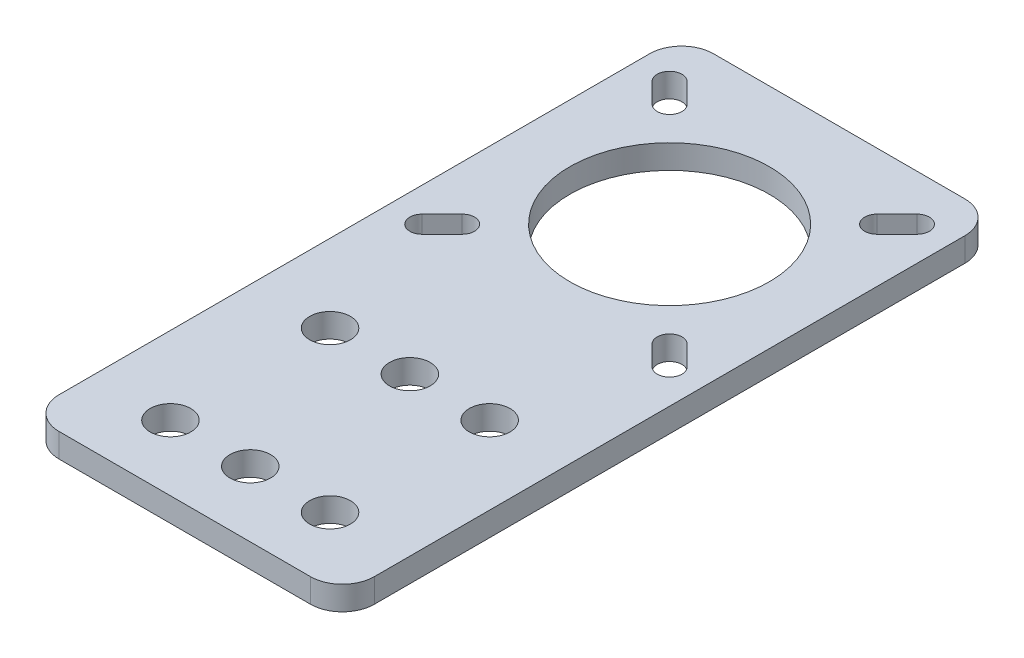
ISO-10303-21;
HEADER;
FILE_DESCRIPTION(('STEP AP214'),'2;1');
FILE_NAME('part.step','',(''),(''),'','','');
FILE_SCHEMA(('AUTOMOTIVE_DESIGN { 1 0 10303 214 1 1 1 1 }'));
ENDSEC;
DATA;
#1=APPLICATION_CONTEXT('core data for automotive mechanical design processes');
#2=APPLICATION_PROTOCOL_DEFINITION('international standard','automotive_design',2000,#1);
#3=PRODUCT_CONTEXT('',#1,'mechanical');
#4=PRODUCT('Part','Part','',(#3));
#5=PRODUCT_RELATED_PRODUCT_CATEGORY('part','',(#4));
#6=PRODUCT_DEFINITION_FORMATION('','',#4);
#7=PRODUCT_DEFINITION_CONTEXT('part definition',#1,'design');
#8=PRODUCT_DEFINITION('design','',#6,#7);
#9=PRODUCT_DEFINITION_SHAPE('','',#8);
#10=(LENGTH_UNIT() NAMED_UNIT(*) SI_UNIT(.MILLI.,.METRE.));
#11=(NAMED_UNIT(*) PLANE_ANGLE_UNIT() SI_UNIT($,.RADIAN.));
#12=(NAMED_UNIT(*) SI_UNIT($,.STERADIAN.) SOLID_ANGLE_UNIT());
#13=UNCERTAINTY_MEASURE_WITH_UNIT(LENGTH_MEASURE(1.E-05),#10,'distance_accuracy_value','');
#14=(GEOMETRIC_REPRESENTATION_CONTEXT(3) GLOBAL_UNCERTAINTY_ASSIGNED_CONTEXT((#13)) GLOBAL_UNIT_ASSIGNED_CONTEXT((#10,
#11,#12)) REPRESENTATION_CONTEXT('',''));
#15=CARTESIAN_POINT('',(0.,0.,0.));
#16=DIRECTION('',(0.,0.,1.));
#17=DIRECTION('',(1.,0.,0.));
#18=AXIS2_PLACEMENT_3D('',#15,#16,#17);
#19=CARTESIAN_POINT('',(-15.75,3.,56.75));
#20=DIRECTION('',(0.,-1.,0.));
#21=DIRECTION('',(0.,0.,-1.));
#22=AXIS2_PLACEMENT_3D('',#19,#20,#21);
#23=PLANE('',#22);
#24=CARTESIAN_POINT('',(-12.9999999999999,3.,13.));
#25=DIRECTION('',(0.,1.,0.));
#26=DIRECTION('',(0.,0.,1.));
#27=AXIS2_PLACEMENT_3D('',#24,#25,#26);
#28=CIRCLE('',#27,1.55);
#29=CARTESIAN_POINT('',(-11.9039844891608,3.,14.0960155108391));
#30=VERTEX_POINT('',#29);
#31=CARTESIAN_POINT('',(-14.0960155108391,3.,11.9039844891609));
#32=VERTEX_POINT('',#31);
#33=EDGE_CURVE('E233',#30,#32,#28,.T.);
#34=ORIENTED_EDGE('',*,*,#33,.F.);
#35=DIRECTION('',(0.707106781186545,0.,-0.70710678118655));
#36=VECTOR('',#35,1.);
#37=CARTESIAN_POINT('',(-11.9039844891608,3.,14.0960155108391));
#38=LINE('',#37,#36);
#39=CARTESIAN_POINT('',(-14.4039844891608,3.,16.5960155108392));
#40=VERTEX_POINT('',#39);
#41=EDGE_CURVE('E241',#40,#30,#38,.T.);
#42=ORIENTED_EDGE('',*,*,#41,.F.);
#43=CARTESIAN_POINT('',(-15.4999999999999,3.,15.5));
#44=DIRECTION('',(0.,1.,0.));
#45=DIRECTION('',(0.,0.,1.));
#46=AXIS2_PLACEMENT_3D('',#43,#44,#45);
#47=CIRCLE('',#46,1.55);
#48=CARTESIAN_POINT('',(-16.5960155108391,3.,14.4039844891608));
#49=VERTEX_POINT('',#48);
#50=EDGE_CURVE('E238',#49,#40,#47,.T.);
#51=ORIENTED_EDGE('',*,*,#50,.F.);
#52=DIRECTION('',(-0.707106781186545,0.,0.70710678118655));
#53=VECTOR('',#52,1.);
#54=CARTESIAN_POINT('',(-14.0960155108391,3.,11.9039844891609));
#55=LINE('',#54,#53);
#56=EDGE_CURVE('E235',#32,#49,#55,.T.);
#57=ORIENTED_EDGE('',*,*,#56,.F.);
#58=EDGE_LOOP('',(#34,#42,#51,#57));
#59=FACE_BOUND('',#58,.T.);
#60=CARTESIAN_POINT('',(-9.99999999999999,3.,32.55));
#61=DIRECTION('',(0.,1.,0.));
#62=DIRECTION('',(0.,0.,1.));
#63=AXIS2_PLACEMENT_3D('',#60,#61,#62);
#64=CIRCLE('',#63,2.55);
#65=CARTESIAN_POINT('',(-9.99999999999999,3.,35.1));
#66=VERTEX_POINT('',#65);
#67=EDGE_CURVE('E295',#66,#66,#64,.T.);
#68=ORIENTED_EDGE('',*,*,#67,.F.);
#69=EDGE_LOOP('',(#68));
#70=FACE_BOUND('',#69,.T.);
#71=CARTESIAN_POINT('',(0.,3.,32.55));
#72=DIRECTION('',(0.,1.,0.));
#73=DIRECTION('',(0.,0.,1.));
#74=AXIS2_PLACEMENT_3D('',#71,#72,#73);
#75=CIRCLE('',#74,2.55);
#76=CARTESIAN_POINT('',(0.,3.,35.1));
#77=VERTEX_POINT('',#76);
#78=EDGE_CURVE('E307',#77,#77,#75,.T.);
#79=ORIENTED_EDGE('',*,*,#78,.F.);
#80=EDGE_LOOP('',(#79));
#81=FACE_BOUND('',#80,.T.);
#82=CARTESIAN_POINT('',(10.,3.,32.55));
#83=DIRECTION('',(0.,1.,0.));
#84=DIRECTION('',(0.,0.,1.));
#85=AXIS2_PLACEMENT_3D('',#82,#83,#84);
#86=CIRCLE('',#85,2.55);
#87=CARTESIAN_POINT('',(10.,3.,35.1));
#88=VERTEX_POINT('',#87);
#89=EDGE_CURVE('E319',#88,#88,#86,.T.);
#90=ORIENTED_EDGE('',*,*,#89,.F.);
#91=EDGE_LOOP('',(#90));
#92=FACE_BOUND('',#91,.T.);
#93=CARTESIAN_POINT('',(12.9999999999999,3.,-13.));
#94=DIRECTION('',(0.,1.,0.));
#95=DIRECTION('',(0.,0.,1.));
#96=AXIS2_PLACEMENT_3D('',#93,#94,#95);
#97=CIRCLE('',#96,1.55);
#98=CARTESIAN_POINT('',(11.9039844891608,3.,-14.0960155108391));
#99=VERTEX_POINT('',#98);
#100=CARTESIAN_POINT('',(14.0960155108391,3.,-11.9039844891608));
#101=VERTEX_POINT('',#100);
#102=EDGE_CURVE('E331',#99,#101,#97,.T.);
#103=ORIENTED_EDGE('',*,*,#102,.F.);
#104=DIRECTION('',(-0.707106781186545,0.,0.70710678118655));
#105=VECTOR('',#104,1.);
#106=CARTESIAN_POINT('',(11.9039844891608,3.,-14.0960155108391));
#107=LINE('',#106,#105);
#108=CARTESIAN_POINT('',(14.4039844891608,3.,-16.5960155108391));
#109=VERTEX_POINT('',#108);
#110=EDGE_CURVE('E339',#109,#99,#107,.T.);
#111=ORIENTED_EDGE('',*,*,#110,.F.);
#112=CARTESIAN_POINT('',(15.4999999999999,3.,-15.5));
#113=DIRECTION('',(0.,1.,0.));
#114=DIRECTION('',(0.,0.,1.));
#115=AXIS2_PLACEMENT_3D('',#112,#113,#114);
#116=CIRCLE('',#115,1.55);
#117=CARTESIAN_POINT('',(16.5960155108391,3.,-14.4039844891608));
#118=VERTEX_POINT('',#117);
#119=EDGE_CURVE('E336',#118,#109,#116,.T.);
#120=ORIENTED_EDGE('',*,*,#119,.F.);
#121=DIRECTION('',(0.707106781186546,0.,-0.707106781186549));
#122=VECTOR('',#121,1.);
#123=CARTESIAN_POINT('',(14.0960155108391,3.,-11.9039844891608));
#124=LINE('',#123,#122);
#125=EDGE_CURVE('E333',#101,#118,#124,.T.);
#126=ORIENTED_EDGE('',*,*,#125,.F.);
#127=EDGE_LOOP('',(#103,#111,#120,#126));
#128=FACE_BOUND('',#127,.T.);
#129=CARTESIAN_POINT('',(-15.75,3.,56.75));
#130=DIRECTION('',(0.,1.,0.));
#131=DIRECTION('',(0.,0.,-1.));
#132=AXIS2_PLACEMENT_3D('',#129,#130,#131);
#133=CIRCLE('',#132,4.00000000000001);
#134=CARTESIAN_POINT('',(-19.75,3.,56.75));
#135=VERTEX_POINT('',#134);
#136=CARTESIAN_POINT('',(-15.75,3.,60.75));
#137=VERTEX_POINT('',#136);
#138=EDGE_CURVE('E368',#135,#137,#133,.T.);
#139=ORIENTED_EDGE('',*,*,#138,.T.);
#140=DIRECTION('',(1.,0.,0.));
#141=VECTOR('',#140,1.);
#142=CARTESIAN_POINT('',(15.75,3.,60.75));
#143=LINE('',#142,#141);
#144=CARTESIAN_POINT('',(15.75,3.,60.75));
#145=VERTEX_POINT('',#144);
#146=EDGE_CURVE('E371',#137,#145,#143,.T.);
#147=ORIENTED_EDGE('',*,*,#146,.T.);
#148=CARTESIAN_POINT('',(15.75,3.,56.75));
#149=DIRECTION('',(0.,1.,0.));
#150=DIRECTION('',(0.,0.,1.));
#151=AXIS2_PLACEMENT_3D('',#148,#149,#150);
#152=CIRCLE('',#151,4.00000000000001);
#153=CARTESIAN_POINT('',(19.75,3.,56.75));
#154=VERTEX_POINT('',#153);
#155=EDGE_CURVE('E374',#145,#154,#152,.T.);
#156=ORIENTED_EDGE('',*,*,#155,.T.);
#157=DIRECTION('',(0.,0.,-1.));
#158=VECTOR('',#157,1.);
#159=CARTESIAN_POINT('',(19.75,3.,56.75));
#160=LINE('',#159,#158);
#161=CARTESIAN_POINT('',(19.75,3.,-17.25));
#162=VERTEX_POINT('',#161);
#163=EDGE_CURVE('E376',#154,#162,#160,.T.);
#164=ORIENTED_EDGE('',*,*,#163,.T.);
#165=CARTESIAN_POINT('',(15.75,3.,-17.25));
#166=DIRECTION('',(0.,1.,0.));
#167=DIRECTION('',(0.,0.,1.));
#168=AXIS2_PLACEMENT_3D('',#165,#166,#167);
#169=CIRCLE('',#168,4.);
#170=CARTESIAN_POINT('',(15.75,3.,-21.25));
#171=VERTEX_POINT('',#170);
#172=EDGE_CURVE('E378',#162,#171,#169,.T.);
#173=ORIENTED_EDGE('',*,*,#172,.T.);
#174=DIRECTION('',(-1.,0.,0.));
#175=VECTOR('',#174,1.);
#176=CARTESIAN_POINT('',(15.75,3.,-21.25));
#177=LINE('',#176,#175);
#178=CARTESIAN_POINT('',(-15.75,3.,-21.25));
#179=VERTEX_POINT('',#178);
#180=EDGE_CURVE('E380',#171,#179,#177,.T.);
#181=ORIENTED_EDGE('',*,*,#180,.T.);
#182=CARTESIAN_POINT('',(-15.75,3.,-17.25));
#183=DIRECTION('',(0.,1.,0.));
#184=DIRECTION('',(0.,0.,1.));
#185=AXIS2_PLACEMENT_3D('',#182,#183,#184);
#186=CIRCLE('',#185,4.);
#187=CARTESIAN_POINT('',(-19.75,3.,-17.25));
#188=VERTEX_POINT('',#187);
#189=EDGE_CURVE('E382',#179,#188,#186,.T.);
#190=ORIENTED_EDGE('',*,*,#189,.T.);
#191=DIRECTION('',(0.,0.,1.));
#192=VECTOR('',#191,1.);
#193=CARTESIAN_POINT('',(-19.75,3.,56.75));
#194=LINE('',#193,#192);
#195=EDGE_CURVE('E384',#188,#135,#194,.T.);
#196=ORIENTED_EDGE('',*,*,#195,.T.);
#197=EDGE_LOOP('',(#139,#147,#156,#164,#173,#181,#190,#196));
#198=FACE_BOUND('',#197,.T.);
#199=CARTESIAN_POINT('',(0.,3.,0.));
#200=DIRECTION('',(0.,1.,0.));
#201=DIRECTION('',(0.,0.,1.));
#202=AXIS2_PLACEMENT_3D('',#199,#200,#201);
#203=CIRCLE('',#202,12.5);
#204=CARTESIAN_POINT('',(0.,3.,12.5));
#205=VERTEX_POINT('',#204);
#206=EDGE_CURVE('E362',#205,#205,#203,.T.);
#207=ORIENTED_EDGE('',*,*,#206,.F.);
#208=EDGE_LOOP('',(#207));
#209=FACE_BOUND('',#208,.T.);
#210=CARTESIAN_POINT('',(10.,3.,52.55));
#211=DIRECTION('',(0.,1.,0.));
#212=DIRECTION('',(0.,0.,1.));
#213=AXIS2_PLACEMENT_3D('',#210,#211,#212);
#214=CIRCLE('',#213,2.55);
#215=CARTESIAN_POINT('',(10.,3.,55.1));
#216=VERTEX_POINT('',#215);
#217=EDGE_CURVE('E325',#216,#216,#214,.T.);
#218=ORIENTED_EDGE('',*,*,#217,.F.);
#219=EDGE_LOOP('',(#218));
#220=FACE_BOUND('',#219,.T.);
#221=CARTESIAN_POINT('',(0.,3.,52.55));
#222=DIRECTION('',(0.,1.,0.));
#223=DIRECTION('',(0.,0.,1.));
#224=AXIS2_PLACEMENT_3D('',#221,#222,#223);
#225=CIRCLE('',#224,2.55);
#226=CARTESIAN_POINT('',(0.,3.,55.1));
#227=VERTEX_POINT('',#226);
#228=EDGE_CURVE('E313',#227,#227,#225,.T.);
#229=ORIENTED_EDGE('',*,*,#228,.F.);
#230=EDGE_LOOP('',(#229));
#231=FACE_BOUND('',#230,.T.);
#232=CARTESIAN_POINT('',(-9.99999999999999,3.,52.55));
#233=DIRECTION('',(0.,1.,0.));
#234=DIRECTION('',(0.,0.,1.));
#235=AXIS2_PLACEMENT_3D('',#232,#233,#234);
#236=CIRCLE('',#235,2.55);
#237=CARTESIAN_POINT('',(-9.99999999999999,3.,55.1));
#238=VERTEX_POINT('',#237);
#239=EDGE_CURVE('E301',#238,#238,#236,.T.);
#240=ORIENTED_EDGE('',*,*,#239,.F.);
#241=EDGE_LOOP('',(#240));
#242=FACE_BOUND('',#241,.T.);
#243=CARTESIAN_POINT('',(-12.9999999999999,3.,-13.));
#244=DIRECTION('',(0.,1.,0.));
#245=DIRECTION('',(0.,0.,-1.));
#246=AXIS2_PLACEMENT_3D('',#243,#244,#245);
#247=CIRCLE('',#246,1.55);
#248=CARTESIAN_POINT('',(-14.0960155108391,3.,-11.9039844891609));
#249=VERTEX_POINT('',#248);
#250=CARTESIAN_POINT('',(-11.9039844891608,3.,-14.0960155108391));
#251=VERTEX_POINT('',#250);
#252=EDGE_CURVE('E264',#249,#251,#247,.T.);
#253=ORIENTED_EDGE('',*,*,#252,.F.);
#254=DIRECTION('',(0.707106781186545,0.,0.70710678118655));
#255=VECTOR('',#254,1.);
#256=CARTESIAN_POINT('',(-14.0960155108391,3.,-11.9039844891609));
#257=LINE('',#256,#255);
#258=CARTESIAN_POINT('',(-16.5960155108391,3.,-14.4039844891609));
#259=VERTEX_POINT('',#258);
#260=EDGE_CURVE('E272',#259,#249,#257,.T.);
#261=ORIENTED_EDGE('',*,*,#260,.F.);
#262=CARTESIAN_POINT('',(-15.4999999999999,3.,-15.5));
#263=DIRECTION('',(0.,1.,0.));
#264=DIRECTION('',(0.,0.,-1.));
#265=AXIS2_PLACEMENT_3D('',#262,#263,#264);
#266=CIRCLE('',#265,1.55);
#267=CARTESIAN_POINT('',(-14.4039844891608,3.,-16.5960155108391));
#268=VERTEX_POINT('',#267);
#269=EDGE_CURVE('E269',#268,#259,#266,.T.);
#270=ORIENTED_EDGE('',*,*,#269,.F.);
#271=DIRECTION('',(-0.707106781186545,0.,-0.70710678118655));
#272=VECTOR('',#271,1.);
#273=CARTESIAN_POINT('',(-11.9039844891608,3.,-14.0960155108391));
#274=LINE('',#273,#272);
#275=EDGE_CURVE('E266',#251,#268,#274,.T.);
#276=ORIENTED_EDGE('',*,*,#275,.F.);
#277=EDGE_LOOP('',(#253,#261,#270,#276));
#278=FACE_BOUND('',#277,.T.);
#279=CARTESIAN_POINT('',(12.9999999999999,3.,13.));
#280=DIRECTION('',(0.,1.,0.));
#281=DIRECTION('',(0.,0.,-1.));
#282=AXIS2_PLACEMENT_3D('',#279,#280,#281);
#283=CIRCLE('',#282,1.55);
#284=CARTESIAN_POINT('',(14.0960155108391,3.,11.9039844891608));
#285=VERTEX_POINT('',#284);
#286=CARTESIAN_POINT('',(11.9039844891608,3.,14.0960155108391));
#287=VERTEX_POINT('',#286);
#288=EDGE_CURVE('E197',#285,#287,#283,.T.);
#289=ORIENTED_EDGE('',*,*,#288,.F.);
#290=DIRECTION('',(-0.707106781186546,0.,-0.707106781186549));
#291=VECTOR('',#290,1.);
#292=CARTESIAN_POINT('',(14.0960155108391,3.,11.9039844891608));
#293=LINE('',#292,#291);
#294=CARTESIAN_POINT('',(16.5960155108391,3.,14.4039844891608));
#295=VERTEX_POINT('',#294);
#296=EDGE_CURVE('E219',#295,#285,#293,.T.);
#297=ORIENTED_EDGE('',*,*,#296,.F.);
#298=CARTESIAN_POINT('',(15.4999999999999,3.,15.5));
#299=DIRECTION('',(0.,1.,0.));
#300=DIRECTION('',(0.,0.,-1.));
#301=AXIS2_PLACEMENT_3D('',#298,#299,#300);
#302=CIRCLE('',#301,1.55);
#303=CARTESIAN_POINT('',(14.4039844891608,3.,16.5960155108391));
#304=VERTEX_POINT('',#303);
#305=EDGE_CURVE('E217',#304,#295,#302,.T.);
#306=ORIENTED_EDGE('',*,*,#305,.F.);
#307=DIRECTION('',(0.707106781186545,0.,0.70710678118655));
#308=VECTOR('',#307,1.);
#309=CARTESIAN_POINT('',(11.9039844891608,3.,14.0960155108391));
#310=LINE('',#309,#308);
#311=EDGE_CURVE('E205',#287,#304,#310,.T.);
#312=ORIENTED_EDGE('',*,*,#311,.F.);
#313=EDGE_LOOP('',(#289,#297,#306,#312));
#314=FACE_BOUND('',#313,.T.);
#315=ADVANCED_FACE('F36',(#59,#70,#81,#92,#128,#198,#209,#220,#231,#242,#278,#314),#23,.F.);
#316=CARTESIAN_POINT('',(-15.75,0.,56.75));
#317=DIRECTION('',(0.,-1.,0.));
#318=DIRECTION('',(0.,0.,-1.));
#319=AXIS2_PLACEMENT_3D('',#316,#317,#318);
#320=PLANE('',#319);
#321=DIRECTION('',(0.707106781186545,0.,-0.70710678118655));
#322=VECTOR('',#321,1.);
#323=CARTESIAN_POINT('',(-11.9039844891608,0.,14.0960155108391));
#324=LINE('',#323,#322);
#325=CARTESIAN_POINT('',(-14.4039844891608,0.,16.5960155108391));
#326=VERTEX_POINT('',#325);
#327=CARTESIAN_POINT('',(-11.9039844891608,0.,14.0960155108391));
#328=VERTEX_POINT('',#327);
#329=EDGE_CURVE('E236',#326,#328,#324,.T.);
#330=ORIENTED_EDGE('',*,*,#329,.T.);
#331=CARTESIAN_POINT('',(-12.9999999999999,0.,13.));
#332=DIRECTION('',(0.,1.,0.));
#333=DIRECTION('',(0.,0.,1.));
#334=AXIS2_PLACEMENT_3D('',#331,#332,#333);
#335=CIRCLE('',#334,1.55);
#336=CARTESIAN_POINT('',(-14.0960155108391,0.,11.9039844891609));
#337=VERTEX_POINT('',#336);
#338=EDGE_CURVE('E213',#328,#337,#335,.T.);
#339=ORIENTED_EDGE('',*,*,#338,.T.);
#340=DIRECTION('',(-0.707106781186545,0.,0.70710678118655));
#341=VECTOR('',#340,1.);
#342=CARTESIAN_POINT('',(-14.0960155108391,0.,11.9039844891609));
#343=LINE('',#342,#341);
#344=CARTESIAN_POINT('',(-16.5960155108391,0.,14.4039844891608));
#345=VERTEX_POINT('',#344);
#346=EDGE_CURVE('E246',#337,#345,#343,.T.);
#347=ORIENTED_EDGE('',*,*,#346,.T.);
#348=CARTESIAN_POINT('',(-15.4999999999999,0.,15.5));
#349=DIRECTION('',(0.,1.,0.));
#350=DIRECTION('',(0.,0.,1.));
#351=AXIS2_PLACEMENT_3D('',#348,#349,#350);
#352=CIRCLE('',#351,1.55);
#353=EDGE_CURVE('E249',#345,#326,#352,.T.);
#354=ORIENTED_EDGE('',*,*,#353,.T.);
#355=EDGE_LOOP('',(#330,#339,#347,#354));
#356=FACE_BOUND('',#355,.T.);
#357=CARTESIAN_POINT('',(-9.99999999999999,0.,32.55));
#358=DIRECTION('',(0.,1.,0.));
#359=DIRECTION('',(0.,0.,1.));
#360=AXIS2_PLACEMENT_3D('',#357,#358,#359);
#361=CIRCLE('',#360,2.55);
#362=CARTESIAN_POINT('',(-9.99999999999999,0.,35.1));
#363=VERTEX_POINT('',#362);
#364=EDGE_CURVE('E294',#363,#363,#361,.T.);
#365=ORIENTED_EDGE('',*,*,#364,.T.);
#366=EDGE_LOOP('',(#365));
#367=FACE_BOUND('',#366,.T.);
#368=CARTESIAN_POINT('',(0.,0.,32.55));
#369=DIRECTION('',(0.,1.,0.));
#370=DIRECTION('',(0.,0.,1.));
#371=AXIS2_PLACEMENT_3D('',#368,#369,#370);
#372=CIRCLE('',#371,2.55);
#373=CARTESIAN_POINT('',(0.,0.,35.1));
#374=VERTEX_POINT('',#373);
#375=EDGE_CURVE('E304',#374,#374,#372,.T.);
#376=ORIENTED_EDGE('',*,*,#375,.T.);
#377=EDGE_LOOP('',(#376));
#378=FACE_BOUND('',#377,.T.);
#379=CARTESIAN_POINT('',(10.,0.,32.55));
#380=DIRECTION('',(0.,1.,0.));
#381=DIRECTION('',(0.,0.,1.));
#382=AXIS2_PLACEMENT_3D('',#379,#380,#381);
#383=CIRCLE('',#382,2.55);
#384=CARTESIAN_POINT('',(10.,0.,35.1));
#385=VERTEX_POINT('',#384);
#386=EDGE_CURVE('E316',#385,#385,#383,.T.);
#387=ORIENTED_EDGE('',*,*,#386,.T.);
#388=EDGE_LOOP('',(#387));
#389=FACE_BOUND('',#388,.T.);
#390=DIRECTION('',(-0.707106781186545,0.,0.70710678118655));
#391=VECTOR('',#390,1.);
#392=CARTESIAN_POINT('',(11.9039844891608,0.,-14.0960155108391));
#393=LINE('',#392,#391);
#394=CARTESIAN_POINT('',(14.4039844891608,0.,-16.5960155108391));
#395=VERTEX_POINT('',#394);
#396=CARTESIAN_POINT('',(11.9039844891608,0.,-14.0960155108391));
#397=VERTEX_POINT('',#396);
#398=EDGE_CURVE('E334',#395,#397,#393,.T.);
#399=ORIENTED_EDGE('',*,*,#398,.T.);
#400=CARTESIAN_POINT('',(12.9999999999999,0.,-13.));
#401=DIRECTION('',(0.,1.,0.));
#402=DIRECTION('',(0.,0.,1.));
#403=AXIS2_PLACEMENT_3D('',#400,#401,#402);
#404=CIRCLE('',#403,1.55);
#405=CARTESIAN_POINT('',(14.0960155108391,0.,-11.9039844891608));
#406=VERTEX_POINT('',#405);
#407=EDGE_CURVE('E328',#397,#406,#404,.T.);
#408=ORIENTED_EDGE('',*,*,#407,.T.);
#409=DIRECTION('',(0.707106781186546,0.,-0.707106781186549));
#410=VECTOR('',#409,1.);
#411=CARTESIAN_POINT('',(14.0960155108391,0.,-11.9039844891608));
#412=LINE('',#411,#410);
#413=CARTESIAN_POINT('',(16.5960155108391,0.,-14.4039844891608));
#414=VERTEX_POINT('',#413);
#415=EDGE_CURVE('E344',#406,#414,#412,.T.);
#416=ORIENTED_EDGE('',*,*,#415,.T.);
#417=CARTESIAN_POINT('',(15.4999999999999,0.,-15.5));
#418=DIRECTION('',(0.,1.,0.));
#419=DIRECTION('',(0.,0.,1.));
#420=AXIS2_PLACEMENT_3D('',#417,#418,#419);
#421=CIRCLE('',#420,1.55);
#422=EDGE_CURVE('E347',#414,#395,#421,.T.);
#423=ORIENTED_EDGE('',*,*,#422,.T.);
#424=EDGE_LOOP('',(#399,#408,#416,#423));
#425=FACE_BOUND('',#424,.T.);
#426=CARTESIAN_POINT('',(-15.75,0.,56.75));
#427=DIRECTION('',(0.,1.,0.));
#428=DIRECTION('',(0.,0.,-1.));
#429=AXIS2_PLACEMENT_3D('',#426,#427,#428);
#430=CIRCLE('',#429,4.00000000000001);
#431=CARTESIAN_POINT('',(-19.75,0.,56.75));
#432=VERTEX_POINT('',#431);
#433=CARTESIAN_POINT('',(-15.75,0.,60.75));
#434=VERTEX_POINT('',#433);
#435=EDGE_CURVE('E365',#432,#434,#430,.T.);
#436=ORIENTED_EDGE('',*,*,#435,.F.);
#437=DIRECTION('',(0.,0.,1.));
#438=VECTOR('',#437,1.);
#439=CARTESIAN_POINT('',(-19.75,0.,56.75));
#440=LINE('',#439,#438);
#441=CARTESIAN_POINT('',(-19.75,0.,-17.25));
#442=VERTEX_POINT('',#441);
#443=EDGE_CURVE('E372',#442,#432,#440,.T.);
#444=ORIENTED_EDGE('',*,*,#443,.F.);
#445=CARTESIAN_POINT('',(-15.75,0.,-17.25));
#446=DIRECTION('',(0.,1.,0.));
#447=DIRECTION('',(0.,0.,1.));
#448=AXIS2_PLACEMENT_3D('',#445,#446,#447);
#449=CIRCLE('',#448,4.);
#450=CARTESIAN_POINT('',(-15.75,0.,-21.25));
#451=VERTEX_POINT('',#450);
#452=EDGE_CURVE('E399',#451,#442,#449,.T.);
#453=ORIENTED_EDGE('',*,*,#452,.F.);
#454=DIRECTION('',(-1.,0.,0.));
#455=VECTOR('',#454,1.);
#456=CARTESIAN_POINT('',(15.75,0.,-21.25));
#457=LINE('',#456,#455);
#458=CARTESIAN_POINT('',(15.75,0.,-21.25));
#459=VERTEX_POINT('',#458);
#460=EDGE_CURVE('E397',#459,#451,#457,.T.);
#461=ORIENTED_EDGE('',*,*,#460,.F.);
#462=CARTESIAN_POINT('',(15.75,0.,-17.25));
#463=DIRECTION('',(0.,1.,0.));
#464=DIRECTION('',(0.,0.,1.));
#465=AXIS2_PLACEMENT_3D('',#462,#463,#464);
#466=CIRCLE('',#465,4.);
#467=CARTESIAN_POINT('',(19.75,0.,-17.25));
#468=VERTEX_POINT('',#467);
#469=EDGE_CURVE('E395',#468,#459,#466,.T.);
#470=ORIENTED_EDGE('',*,*,#469,.F.);
#471=DIRECTION('',(0.,0.,-1.));
#472=VECTOR('',#471,1.);
#473=CARTESIAN_POINT('',(19.75,0.,56.75));
#474=LINE('',#473,#472);
#475=CARTESIAN_POINT('',(19.75,0.,56.75));
#476=VERTEX_POINT('',#475);
#477=EDGE_CURVE('E393',#476,#468,#474,.T.);
#478=ORIENTED_EDGE('',*,*,#477,.F.);
#479=CARTESIAN_POINT('',(15.75,0.,56.75));
#480=DIRECTION('',(0.,1.,0.));
#481=DIRECTION('',(0.,0.,1.));
#482=AXIS2_PLACEMENT_3D('',#479,#480,#481);
#483=CIRCLE('',#482,4.00000000000001);
#484=CARTESIAN_POINT('',(15.75,0.,60.75));
#485=VERTEX_POINT('',#484);
#486=EDGE_CURVE('E391',#485,#476,#483,.T.);
#487=ORIENTED_EDGE('',*,*,#486,.F.);
#488=DIRECTION('',(1.,0.,0.));
#489=VECTOR('',#488,1.);
#490=CARTESIAN_POINT('',(15.75,0.,60.75));
#491=LINE('',#490,#489);
#492=EDGE_CURVE('E389',#434,#485,#491,.T.);
#493=ORIENTED_EDGE('',*,*,#492,.F.);
#494=EDGE_LOOP('',(#436,#444,#453,#461,#470,#478,#487,#493));
#495=FACE_BOUND('',#494,.T.);
#496=CARTESIAN_POINT('',(0.,0.,0.));
#497=DIRECTION('',(0.,1.,0.));
#498=DIRECTION('',(0.,0.,1.));
#499=AXIS2_PLACEMENT_3D('',#496,#497,#498);
#500=CIRCLE('',#499,12.5);
#501=CARTESIAN_POINT('',(0.,0.,12.5));
#502=VERTEX_POINT('',#501);
#503=EDGE_CURVE('E361',#502,#502,#500,.T.);
#504=ORIENTED_EDGE('',*,*,#503,.T.);
#505=EDGE_LOOP('',(#504));
#506=FACE_BOUND('',#505,.T.);
#507=CARTESIAN_POINT('',(10.,0.,52.55));
#508=DIRECTION('',(0.,1.,0.));
#509=DIRECTION('',(0.,0.,1.));
#510=AXIS2_PLACEMENT_3D('',#507,#508,#509);
#511=CIRCLE('',#510,2.55);
#512=CARTESIAN_POINT('',(10.,0.,55.1));
#513=VERTEX_POINT('',#512);
#514=EDGE_CURVE('E322',#513,#513,#511,.T.);
#515=ORIENTED_EDGE('',*,*,#514,.T.);
#516=EDGE_LOOP('',(#515));
#517=FACE_BOUND('',#516,.T.);
#518=CARTESIAN_POINT('',(0.,0.,52.55));
#519=DIRECTION('',(0.,1.,0.));
#520=DIRECTION('',(0.,0.,1.));
#521=AXIS2_PLACEMENT_3D('',#518,#519,#520);
#522=CIRCLE('',#521,2.55);
#523=CARTESIAN_POINT('',(0.,0.,55.1));
#524=VERTEX_POINT('',#523);
#525=EDGE_CURVE('E310',#524,#524,#522,.T.);
#526=ORIENTED_EDGE('',*,*,#525,.T.);
#527=EDGE_LOOP('',(#526));
#528=FACE_BOUND('',#527,.T.);
#529=CARTESIAN_POINT('',(-9.99999999999999,0.,52.55));
#530=DIRECTION('',(0.,1.,0.));
#531=DIRECTION('',(0.,0.,1.));
#532=AXIS2_PLACEMENT_3D('',#529,#530,#531);
#533=CIRCLE('',#532,2.55);
#534=CARTESIAN_POINT('',(-9.99999999999999,0.,55.1));
#535=VERTEX_POINT('',#534);
#536=EDGE_CURVE('E298',#535,#535,#533,.T.);
#537=ORIENTED_EDGE('',*,*,#536,.T.);
#538=EDGE_LOOP('',(#537));
#539=FACE_BOUND('',#538,.T.);
#540=DIRECTION('',(0.707106781186545,0.,0.70710678118655));
#541=VECTOR('',#540,1.);
#542=CARTESIAN_POINT('',(-14.0960155108391,0.,-11.9039844891609));
#543=LINE('',#542,#541);
#544=CARTESIAN_POINT('',(-16.5960155108391,0.,-14.4039844891608));
#545=VERTEX_POINT('',#544);
#546=CARTESIAN_POINT('',(-14.0960155108391,0.,-11.9039844891609));
#547=VERTEX_POINT('',#546);
#548=EDGE_CURVE('E267',#545,#547,#543,.T.);
#549=ORIENTED_EDGE('',*,*,#548,.T.);
#550=CARTESIAN_POINT('',(-12.9999999999999,0.,-13.));
#551=DIRECTION('',(0.,1.,0.));
#552=DIRECTION('',(0.,0.,-1.));
#553=AXIS2_PLACEMENT_3D('',#550,#551,#552);
#554=CIRCLE('',#553,1.55);
#555=CARTESIAN_POINT('',(-11.9039844891608,0.,-14.0960155108391));
#556=VERTEX_POINT('',#555);
#557=EDGE_CURVE('E263',#547,#556,#554,.T.);
#558=ORIENTED_EDGE('',*,*,#557,.T.);
#559=DIRECTION('',(-0.707106781186545,0.,-0.70710678118655));
#560=VECTOR('',#559,1.);
#561=CARTESIAN_POINT('',(-11.9039844891608,0.,-14.0960155108391));
#562=LINE('',#561,#560);
#563=CARTESIAN_POINT('',(-14.4039844891608,0.,-16.5960155108391));
#564=VERTEX_POINT('',#563);
#565=EDGE_CURVE('E277',#556,#564,#562,.T.);
#566=ORIENTED_EDGE('',*,*,#565,.T.);
#567=CARTESIAN_POINT('',(-15.4999999999999,0.,-15.5));
#568=DIRECTION('',(0.,1.,0.));
#569=DIRECTION('',(0.,0.,-1.));
#570=AXIS2_PLACEMENT_3D('',#567,#568,#569);
#571=CIRCLE('',#570,1.55);
#572=EDGE_CURVE('E280',#564,#545,#571,.T.);
#573=ORIENTED_EDGE('',*,*,#572,.T.);
#574=EDGE_LOOP('',(#549,#558,#566,#573));
#575=FACE_BOUND('',#574,.T.);
#576=DIRECTION('',(-0.707106781186546,0.,-0.707106781186549));
#577=VECTOR('',#576,1.);
#578=CARTESIAN_POINT('',(14.0960155108391,0.,11.9039844891608));
#579=LINE('',#578,#577);
#580=CARTESIAN_POINT('',(16.5960155108391,0.,14.4039844891608));
#581=VERTEX_POINT('',#580);
#582=CARTESIAN_POINT('',(14.0960155108391,0.,11.9039844891608));
#583=VERTEX_POINT('',#582);
#584=EDGE_CURVE('E206',#581,#583,#579,.T.);
#585=ORIENTED_EDGE('',*,*,#584,.T.);
#586=CARTESIAN_POINT('',(12.9999999999999,0.,13.));
#587=DIRECTION('',(0.,1.,0.));
#588=DIRECTION('',(0.,0.,-1.));
#589=AXIS2_PLACEMENT_3D('',#586,#587,#588);
#590=CIRCLE('',#589,1.55);
#591=CARTESIAN_POINT('',(11.9039844891608,0.,14.0960155108391));
#592=VERTEX_POINT('',#591);
#593=EDGE_CURVE('E59',#583,#592,#590,.T.);
#594=ORIENTED_EDGE('',*,*,#593,.T.);
#595=DIRECTION('',(0.707106781186545,0.,0.70710678118655));
#596=VECTOR('',#595,1.);
#597=CARTESIAN_POINT('',(11.9039844891608,0.,14.0960155108391));
#598=LINE('',#597,#596);
#599=CARTESIAN_POINT('',(14.4039844891608,0.,16.5960155108391));
#600=VERTEX_POINT('',#599);
#601=EDGE_CURVE('E212',#592,#600,#598,.T.);
#602=ORIENTED_EDGE('',*,*,#601,.T.);
#603=CARTESIAN_POINT('',(15.4999999999999,0.,15.5));
#604=DIRECTION('',(0.,1.,0.));
#605=DIRECTION('',(0.,0.,-1.));
#606=AXIS2_PLACEMENT_3D('',#603,#604,#605);
#607=CIRCLE('',#606,1.55);
#608=EDGE_CURVE('E225',#600,#581,#607,.T.);
#609=ORIENTED_EDGE('',*,*,#608,.T.);
#610=EDGE_LOOP('',(#585,#594,#602,#609));
#611=FACE_BOUND('',#610,.T.);
#612=ADVANCED_FACE('F429',(#356,#367,#378,#389,#425,#495,#506,#517,#528,#539,#575,#611),#320,.T.);
#613=CARTESIAN_POINT('',(-15.75,3.,56.75));
#614=DIRECTION('',(0.,-1.,0.));
#615=DIRECTION('',(0.,0.,-1.));
#616=AXIS2_PLACEMENT_3D('',#613,#614,#615);
#617=CYLINDRICAL_SURFACE('',#616,4.00000000000001);
#618=ORIENTED_EDGE('',*,*,#435,.T.);
#619=DIRECTION('',(0.,-1.,0.));
#620=VECTOR('',#619,1.);
#621=CARTESIAN_POINT('',(-15.75,3.,60.75));
#622=LINE('',#621,#620);
#623=EDGE_CURVE('E11',#137,#434,#622,.T.);
#624=ORIENTED_EDGE('',*,*,#623,.F.);
#625=ORIENTED_EDGE('',*,*,#138,.F.);
#626=DIRECTION('',(0.,-1.,0.));
#627=VECTOR('',#626,1.);
#628=CARTESIAN_POINT('',(-19.75,3.,56.75));
#629=LINE('',#628,#627);
#630=EDGE_CURVE('E386',#135,#432,#629,.T.);
#631=ORIENTED_EDGE('',*,*,#630,.T.);
#632=EDGE_LOOP('',(#618,#624,#625,#631));
#633=FACE_BOUND('',#632,.T.);
#634=ADVANCED_FACE('F38',(#633),#617,.T.);
#635=CARTESIAN_POINT('',(15.75,3.,60.75));
#636=DIRECTION('',(0.,0.,-1.));
#637=DIRECTION('',(-1.,0.,0.));
#638=AXIS2_PLACEMENT_3D('',#635,#636,#637);
#639=PLANE('',#638);
#640=ORIENTED_EDGE('',*,*,#492,.T.);
#641=DIRECTION('',(0.,-1.,0.));
#642=VECTOR('',#641,1.);
#643=CARTESIAN_POINT('',(15.75,3.,60.75));
#644=LINE('',#643,#642);
#645=EDGE_CURVE('E44',#145,#485,#644,.T.);
#646=ORIENTED_EDGE('',*,*,#645,.F.);
#647=ORIENTED_EDGE('',*,*,#146,.F.);
#648=ORIENTED_EDGE('',*,*,#623,.T.);
#649=EDGE_LOOP('',(#640,#646,#647,#648));
#650=FACE_BOUND('',#649,.T.);
#651=ADVANCED_FACE('F447',(#650),#639,.F.);
#652=CARTESIAN_POINT('',(15.75,3.,56.75));
#653=DIRECTION('',(0.,-1.,0.));
#654=DIRECTION('',(0.,0.,-1.));
#655=AXIS2_PLACEMENT_3D('',#652,#653,#654);
#656=CYLINDRICAL_SURFACE('',#655,4.00000000000001);
#657=ORIENTED_EDGE('',*,*,#486,.T.);
#658=DIRECTION('',(0.,-1.,0.));
#659=VECTOR('',#658,1.);
#660=CARTESIAN_POINT('',(19.75,3.,56.75));
#661=LINE('',#660,#659);
#662=EDGE_CURVE('E416',#154,#476,#661,.T.);
#663=ORIENTED_EDGE('',*,*,#662,.F.);
#664=ORIENTED_EDGE('',*,*,#155,.F.);
#665=ORIENTED_EDGE('',*,*,#645,.T.);
#666=EDGE_LOOP('',(#657,#663,#664,#665));
#667=FACE_BOUND('',#666,.T.);
#668=ADVANCED_FACE('F423',(#667),#656,.T.);
#669=CARTESIAN_POINT('',(19.75,3.,56.75));
#670=DIRECTION('',(-1.,0.,0.));
#671=DIRECTION('',(0.,0.,1.));
#672=AXIS2_PLACEMENT_3D('',#669,#670,#671);
#673=PLANE('',#672);
#674=ORIENTED_EDGE('',*,*,#477,.T.);
#675=DIRECTION('',(0.,-1.,0.));
#676=VECTOR('',#675,1.);
#677=CARTESIAN_POINT('',(19.75,3.,-17.25));
#678=LINE('',#677,#676);
#679=EDGE_CURVE('E413',#162,#468,#678,.T.);
#680=ORIENTED_EDGE('',*,*,#679,.F.);
#681=ORIENTED_EDGE('',*,*,#163,.F.);
#682=ORIENTED_EDGE('',*,*,#662,.T.);
#683=EDGE_LOOP('',(#674,#680,#681,#682));
#684=FACE_BOUND('',#683,.T.);
#685=ADVANCED_FACE('F435',(#684),#673,.F.);
#686=CARTESIAN_POINT('',(15.75,3.,-17.25));
#687=DIRECTION('',(0.,-1.,0.));
#688=DIRECTION('',(0.,0.,-1.));
#689=AXIS2_PLACEMENT_3D('',#686,#687,#688);
#690=CYLINDRICAL_SURFACE('',#689,4.);
#691=ORIENTED_EDGE('',*,*,#469,.T.);
#692=DIRECTION('',(0.,-1.,0.));
#693=VECTOR('',#692,1.);
#694=CARTESIAN_POINT('',(15.75,3.,-21.25));
#695=LINE('',#694,#693);
#696=EDGE_CURVE('E410',#171,#459,#695,.T.);
#697=ORIENTED_EDGE('',*,*,#696,.F.);
#698=ORIENTED_EDGE('',*,*,#172,.F.);
#699=ORIENTED_EDGE('',*,*,#679,.T.);
#700=EDGE_LOOP('',(#691,#697,#698,#699));
#701=FACE_BOUND('',#700,.T.);
#702=ADVANCED_FACE('F439',(#701),#690,.T.);
#703=CARTESIAN_POINT('',(15.75,3.,-21.25));
#704=DIRECTION('',(0.,0.,1.));
#705=DIRECTION('',(1.,0.,0.));
#706=AXIS2_PLACEMENT_3D('',#703,#704,#705);
#707=PLANE('',#706);
#708=ORIENTED_EDGE('',*,*,#460,.T.);
#709=DIRECTION('',(0.,-1.,0.));
#710=VECTOR('',#709,1.);
#711=CARTESIAN_POINT('',(-15.75,3.,-21.25));
#712=LINE('',#711,#710);
#713=EDGE_CURVE('E407',#179,#451,#712,.T.);
#714=ORIENTED_EDGE('',*,*,#713,.F.);
#715=ORIENTED_EDGE('',*,*,#180,.F.);
#716=ORIENTED_EDGE('',*,*,#696,.T.);
#717=EDGE_LOOP('',(#708,#714,#715,#716));
#718=FACE_BOUND('',#717,.T.);
#719=ADVANCED_FACE('F460',(#718),#707,.F.);
#720=CARTESIAN_POINT('',(-15.75,3.,-17.25));
#721=DIRECTION('',(0.,-1.,0.));
#722=DIRECTION('',(0.,0.,-1.));
#723=AXIS2_PLACEMENT_3D('',#720,#721,#722);
#724=CYLINDRICAL_SURFACE('',#723,4.);
#725=ORIENTED_EDGE('',*,*,#452,.T.);
#726=DIRECTION('',(0.,-1.,0.));
#727=VECTOR('',#726,1.);
#728=CARTESIAN_POINT('',(-19.75,3.,-17.25));
#729=LINE('',#728,#727);
#730=EDGE_CURVE('E404',#188,#442,#729,.T.);
#731=ORIENTED_EDGE('',*,*,#730,.F.);
#732=ORIENTED_EDGE('',*,*,#189,.F.);
#733=ORIENTED_EDGE('',*,*,#713,.T.);
#734=EDGE_LOOP('',(#725,#731,#732,#733));
#735=FACE_BOUND('',#734,.T.);
#736=ADVANCED_FACE('F458',(#735),#724,.T.);
#737=CARTESIAN_POINT('',(-19.75,3.,56.75));
#738=DIRECTION('',(1.,0.,0.));
#739=DIRECTION('',(0.,0.,-1.));
#740=AXIS2_PLACEMENT_3D('',#737,#738,#739);
#741=PLANE('',#740);
#742=ORIENTED_EDGE('',*,*,#443,.T.);
#743=ORIENTED_EDGE('',*,*,#630,.F.);
#744=ORIENTED_EDGE('',*,*,#195,.F.);
#745=ORIENTED_EDGE('',*,*,#730,.T.);
#746=EDGE_LOOP('',(#742,#743,#744,#745));
#747=FACE_BOUND('',#746,.T.);
#748=ADVANCED_FACE('F453',(#747),#741,.F.);
#749=CARTESIAN_POINT('',(0.,3.,0.));
#750=DIRECTION('',(0.,-1.,0.));
#751=DIRECTION('',(0.,0.,-1.));
#752=AXIS2_PLACEMENT_3D('',#749,#750,#751);
#753=CYLINDRICAL_SURFACE('',#752,12.5);
#754=ORIENTED_EDGE('',*,*,#206,.T.);
#755=EDGE_LOOP('',(#754));
#756=FACE_BOUND('',#755,.T.);
#757=ORIENTED_EDGE('',*,*,#503,.F.);
#758=EDGE_LOOP('',(#757));
#759=FACE_BOUND('',#758,.T.);
#760=ADVANCED_FACE('F480',(#756,#759),#753,.F.);
#761=CARTESIAN_POINT('',(12.9999999999999,3.,-13.));
#762=DIRECTION('',(0.,-1.,0.));
#763=DIRECTION('',(0.,0.,-1.));
#764=AXIS2_PLACEMENT_3D('',#761,#762,#763);
#765=CYLINDRICAL_SURFACE('',#764,1.55);
#766=ORIENTED_EDGE('',*,*,#407,.F.);
#767=DIRECTION('',(0.,-1.,0.));
#768=VECTOR('',#767,1.);
#769=CARTESIAN_POINT('',(11.9039844891608,3.,-14.0960155108391));
#770=LINE('',#769,#768);
#771=EDGE_CURVE('E341',#99,#397,#770,.T.);
#772=ORIENTED_EDGE('',*,*,#771,.F.);
#773=ORIENTED_EDGE('',*,*,#102,.T.);
#774=DIRECTION('',(0.,-1.,0.));
#775=VECTOR('',#774,1.);
#776=CARTESIAN_POINT('',(14.0960155108391,3.,-11.9039844891608));
#777=LINE('',#776,#775);
#778=EDGE_CURVE('E358',#101,#406,#777,.T.);
#779=ORIENTED_EDGE('',*,*,#778,.T.);
#780=EDGE_LOOP('',(#766,#772,#773,#779));
#781=FACE_BOUND('',#780,.T.);
#782=ADVANCED_FACE('F487',(#781),#765,.F.);
#783=CARTESIAN_POINT('',(14.0960155108391,3.,-11.9039844891608));
#784=DIRECTION('',(-0.707106781186549,0.,-0.707106781186546));
#785=DIRECTION('',(-0.707106781186546,0.,0.707106781186549));
#786=AXIS2_PLACEMENT_3D('',#783,#784,#785);
#787=PLANE('',#786);
#788=ORIENTED_EDGE('',*,*,#415,.F.);
#789=ORIENTED_EDGE('',*,*,#778,.F.);
#790=ORIENTED_EDGE('',*,*,#125,.T.);
#791=DIRECTION('',(0.,-1.,0.));
#792=VECTOR('',#791,1.);
#793=CARTESIAN_POINT('',(16.5960155108391,3.,-14.4039844891608));
#794=LINE('',#793,#792);
#795=EDGE_CURVE('E356',#118,#414,#794,.T.);
#796=ORIENTED_EDGE('',*,*,#795,.T.);
#797=EDGE_LOOP('',(#788,#789,#790,#796));
#798=FACE_BOUND('',#797,.T.);
#799=ADVANCED_FACE('F492',(#798),#787,.T.);
#800=CARTESIAN_POINT('',(15.4999999999999,3.,-15.5));
#801=DIRECTION('',(0.,-1.,0.));
#802=DIRECTION('',(0.,0.,-1.));
#803=AXIS2_PLACEMENT_3D('',#800,#801,#802);
#804=CYLINDRICAL_SURFACE('',#803,1.55);
#805=ORIENTED_EDGE('',*,*,#422,.F.);
#806=ORIENTED_EDGE('',*,*,#795,.F.);
#807=ORIENTED_EDGE('',*,*,#119,.T.);
#808=DIRECTION('',(0.,-1.,0.));
#809=VECTOR('',#808,1.);
#810=CARTESIAN_POINT('',(14.4039844891608,3.,-16.5960155108391));
#811=LINE('',#810,#809);
#812=EDGE_CURVE('E354',#109,#395,#811,.T.);
#813=ORIENTED_EDGE('',*,*,#812,.T.);
#814=EDGE_LOOP('',(#805,#806,#807,#813));
#815=FACE_BOUND('',#814,.T.);
#816=ADVANCED_FACE('F580',(#815),#804,.F.);
#817=CARTESIAN_POINT('',(11.9039844891608,3.,-14.0960155108391));
#818=DIRECTION('',(0.70710678118655,0.,0.707106781186544));
#819=DIRECTION('',(0.707106781186545,0.,-0.70710678118655));
#820=AXIS2_PLACEMENT_3D('',#817,#818,#819);
#821=PLANE('',#820);
#822=ORIENTED_EDGE('',*,*,#398,.F.);
#823=ORIENTED_EDGE('',*,*,#812,.F.);
#824=ORIENTED_EDGE('',*,*,#110,.T.);
#825=ORIENTED_EDGE('',*,*,#771,.T.);
#826=EDGE_LOOP('',(#822,#823,#824,#825));
#827=FACE_BOUND('',#826,.T.);
#828=ADVANCED_FACE('F576',(#827),#821,.T.);
#829=CARTESIAN_POINT('',(10.,3.,52.55));
#830=DIRECTION('',(0.,-1.,0.));
#831=DIRECTION('',(0.,0.,-1.));
#832=AXIS2_PLACEMENT_3D('',#829,#830,#831);
#833=CYLINDRICAL_SURFACE('',#832,2.55);
#834=ORIENTED_EDGE('',*,*,#217,.T.);
#835=EDGE_LOOP('',(#834));
#836=FACE_BOUND('',#835,.T.);
#837=ORIENTED_EDGE('',*,*,#514,.F.);
#838=EDGE_LOOP('',(#837));
#839=FACE_BOUND('',#838,.T.);
#840=ADVANCED_FACE('F572',(#836,#839),#833,.F.);
#841=CARTESIAN_POINT('',(10.,3.,32.55));
#842=DIRECTION('',(0.,-1.,0.));
#843=DIRECTION('',(0.,0.,-1.));
#844=AXIS2_PLACEMENT_3D('',#841,#842,#843);
#845=CYLINDRICAL_SURFACE('',#844,2.55);
#846=ORIENTED_EDGE('',*,*,#89,.T.);
#847=EDGE_LOOP('',(#846));
#848=FACE_BOUND('',#847,.T.);
#849=ORIENTED_EDGE('',*,*,#386,.F.);
#850=EDGE_LOOP('',(#849));
#851=FACE_BOUND('',#850,.T.);
#852=ADVANCED_FACE('F568',(#848,#851),#845,.F.);
#853=CARTESIAN_POINT('',(0.,3.,52.55));
#854=DIRECTION('',(0.,-1.,0.));
#855=DIRECTION('',(0.,0.,-1.));
#856=AXIS2_PLACEMENT_3D('',#853,#854,#855);
#857=CYLINDRICAL_SURFACE('',#856,2.55);
#858=ORIENTED_EDGE('',*,*,#228,.T.);
#859=EDGE_LOOP('',(#858));
#860=FACE_BOUND('',#859,.T.);
#861=ORIENTED_EDGE('',*,*,#525,.F.);
#862=EDGE_LOOP('',(#861));
#863=FACE_BOUND('',#862,.T.);
#864=ADVANCED_FACE('F564',(#860,#863),#857,.F.);
#865=CARTESIAN_POINT('',(0.,3.,32.55));
#866=DIRECTION('',(0.,-1.,0.));
#867=DIRECTION('',(0.,0.,-1.));
#868=AXIS2_PLACEMENT_3D('',#865,#866,#867);
#869=CYLINDRICAL_SURFACE('',#868,2.55);
#870=ORIENTED_EDGE('',*,*,#78,.T.);
#871=EDGE_LOOP('',(#870));
#872=FACE_BOUND('',#871,.T.);
#873=ORIENTED_EDGE('',*,*,#375,.F.);
#874=EDGE_LOOP('',(#873));
#875=FACE_BOUND('',#874,.T.);
#876=ADVANCED_FACE('F560',(#872,#875),#869,.F.);
#877=CARTESIAN_POINT('',(-9.99999999999999,3.,52.55));
#878=DIRECTION('',(0.,-1.,0.));
#879=DIRECTION('',(0.,0.,-1.));
#880=AXIS2_PLACEMENT_3D('',#877,#878,#879);
#881=CYLINDRICAL_SURFACE('',#880,2.55);
#882=ORIENTED_EDGE('',*,*,#239,.T.);
#883=EDGE_LOOP('',(#882));
#884=FACE_BOUND('',#883,.T.);
#885=ORIENTED_EDGE('',*,*,#536,.F.);
#886=EDGE_LOOP('',(#885));
#887=FACE_BOUND('',#886,.T.);
#888=ADVANCED_FACE('F556',(#884,#887),#881,.F.);
#889=CARTESIAN_POINT('',(-9.99999999999999,3.,32.55));
#890=DIRECTION('',(0.,-1.,0.));
#891=DIRECTION('',(0.,0.,-1.));
#892=AXIS2_PLACEMENT_3D('',#889,#890,#891);
#893=CYLINDRICAL_SURFACE('',#892,2.55);
#894=ORIENTED_EDGE('',*,*,#67,.T.);
#895=EDGE_LOOP('',(#894));
#896=FACE_BOUND('',#895,.T.);
#897=ORIENTED_EDGE('',*,*,#364,.F.);
#898=EDGE_LOOP('',(#897));
#899=FACE_BOUND('',#898,.T.);
#900=ADVANCED_FACE('F552',(#896,#899),#893,.F.);
#901=CARTESIAN_POINT('',(-12.9999999999999,3.,-13.));
#902=DIRECTION('',(0.,-1.,0.));
#903=DIRECTION('',(0.,0.,-1.));
#904=AXIS2_PLACEMENT_3D('',#901,#902,#903);
#905=CYLINDRICAL_SURFACE('',#904,1.55);
#906=ORIENTED_EDGE('',*,*,#557,.F.);
#907=DIRECTION('',(0.,-1.,0.));
#908=VECTOR('',#907,1.);
#909=CARTESIAN_POINT('',(-14.0960155108391,3.,-11.9039844891609));
#910=LINE('',#909,#908);
#911=EDGE_CURVE('E274',#249,#547,#910,.T.);
#912=ORIENTED_EDGE('',*,*,#911,.F.);
#913=ORIENTED_EDGE('',*,*,#252,.T.);
#914=DIRECTION('',(0.,-1.,0.));
#915=VECTOR('',#914,1.);
#916=CARTESIAN_POINT('',(-11.9039844891608,3.,-14.0960155108391));
#917=LINE('',#916,#915);
#918=EDGE_CURVE('E291',#251,#556,#917,.T.);
#919=ORIENTED_EDGE('',*,*,#918,.T.);
#920=EDGE_LOOP('',(#906,#912,#913,#919));
#921=FACE_BOUND('',#920,.T.);
#922=ADVANCED_FACE('F548',(#921),#905,.F.);
#923=CARTESIAN_POINT('',(-11.9039844891608,3.,-14.0960155108391));
#924=DIRECTION('',(-0.70710678118655,0.,0.707106781186544));
#925=DIRECTION('',(0.707106781186545,0.,0.70710678118655));
#926=AXIS2_PLACEMENT_3D('',#923,#924,#925);
#927=PLANE('',#926);
#928=ORIENTED_EDGE('',*,*,#565,.F.);
#929=ORIENTED_EDGE('',*,*,#918,.F.);
#930=ORIENTED_EDGE('',*,*,#275,.T.);
#931=DIRECTION('',(0.,-1.,0.));
#932=VECTOR('',#931,1.);
#933=CARTESIAN_POINT('',(-14.4039844891608,3.,-16.5960155108391));
#934=LINE('',#933,#932);
#935=EDGE_CURVE('E289',#268,#564,#934,.T.);
#936=ORIENTED_EDGE('',*,*,#935,.T.);
#937=EDGE_LOOP('',(#928,#929,#930,#936));
#938=FACE_BOUND('',#937,.T.);
#939=ADVANCED_FACE('F544',(#938),#927,.T.);
#940=CARTESIAN_POINT('',(-15.4999999999999,3.,-15.5));
#941=DIRECTION('',(0.,-1.,0.));
#942=DIRECTION('',(0.,0.,-1.));
#943=AXIS2_PLACEMENT_3D('',#940,#941,#942);
#944=CYLINDRICAL_SURFACE('',#943,1.55);
#945=ORIENTED_EDGE('',*,*,#572,.F.);
#946=ORIENTED_EDGE('',*,*,#935,.F.);
#947=ORIENTED_EDGE('',*,*,#269,.T.);
#948=DIRECTION('',(0.,-1.,0.));
#949=VECTOR('',#948,1.);
#950=CARTESIAN_POINT('',(-16.5960155108391,3.,-14.4039844891608));
#951=LINE('',#950,#949);
#952=EDGE_CURVE('E287',#259,#545,#951,.T.);
#953=ORIENTED_EDGE('',*,*,#952,.T.);
#954=EDGE_LOOP('',(#945,#946,#947,#953));
#955=FACE_BOUND('',#954,.T.);
#956=ADVANCED_FACE('F540',(#955),#944,.F.);
#957=CARTESIAN_POINT('',(-14.0960155108391,3.,-11.9039844891609));
#958=DIRECTION('',(0.70710678118655,0.,-0.707106781186545));
#959=DIRECTION('',(-0.707106781186545,0.,-0.70710678118655));
#960=AXIS2_PLACEMENT_3D('',#957,#958,#959);
#961=PLANE('',#960);
#962=ORIENTED_EDGE('',*,*,#548,.F.);
#963=ORIENTED_EDGE('',*,*,#952,.F.);
#964=ORIENTED_EDGE('',*,*,#260,.T.);
#965=ORIENTED_EDGE('',*,*,#911,.T.);
#966=EDGE_LOOP('',(#962,#963,#964,#965));
#967=FACE_BOUND('',#966,.T.);
#968=ADVANCED_FACE('F536',(#967),#961,.T.);
#969=CARTESIAN_POINT('',(-12.9999999999999,3.,13.));
#970=DIRECTION('',(0.,-1.,0.));
#971=DIRECTION('',(0.,0.,-1.));
#972=AXIS2_PLACEMENT_3D('',#969,#970,#971);
#973=CYLINDRICAL_SURFACE('',#972,1.55);
#974=ORIENTED_EDGE('',*,*,#338,.F.);
#975=DIRECTION('',(0.,-1.,0.));
#976=VECTOR('',#975,1.);
#977=CARTESIAN_POINT('',(-11.9039844891608,3.,14.0960155108391));
#978=LINE('',#977,#976);
#979=EDGE_CURVE('E243',#30,#328,#978,.T.);
#980=ORIENTED_EDGE('',*,*,#979,.F.);
#981=ORIENTED_EDGE('',*,*,#33,.T.);
#982=DIRECTION('',(0.,-1.,0.));
#983=VECTOR('',#982,1.);
#984=CARTESIAN_POINT('',(-14.0960155108391,3.,11.9039844891609));
#985=LINE('',#984,#983);
#986=EDGE_CURVE('E260',#32,#337,#985,.T.);
#987=ORIENTED_EDGE('',*,*,#986,.T.);
#988=EDGE_LOOP('',(#974,#980,#981,#987));
#989=FACE_BOUND('',#988,.T.);
#990=ADVANCED_FACE('F532',(#989),#973,.F.);
#991=CARTESIAN_POINT('',(-14.0960155108391,3.,11.9039844891609));
#992=DIRECTION('',(0.70710678118655,0.,0.707106781186545));
#993=DIRECTION('',(0.707106781186545,0.,-0.70710678118655));
#994=AXIS2_PLACEMENT_3D('',#991,#992,#993);
#995=PLANE('',#994);
#996=ORIENTED_EDGE('',*,*,#346,.F.);
#997=ORIENTED_EDGE('',*,*,#986,.F.);
#998=ORIENTED_EDGE('',*,*,#56,.T.);
#999=DIRECTION('',(0.,-1.,0.));
#1000=VECTOR('',#999,1.);
#1001=CARTESIAN_POINT('',(-16.5960155108391,3.,14.4039844891608));
#1002=LINE('',#1001,#1000);
#1003=EDGE_CURVE('E258',#49,#345,#1002,.T.);
#1004=ORIENTED_EDGE('',*,*,#1003,.T.);
#1005=EDGE_LOOP('',(#996,#997,#998,#1004));
#1006=FACE_BOUND('',#1005,.T.);
#1007=ADVANCED_FACE('F528',(#1006),#995,.T.);
#1008=CARTESIAN_POINT('',(-15.4999999999999,3.,15.5));
#1009=DIRECTION('',(0.,-1.,0.));
#1010=DIRECTION('',(0.,0.,-1.));
#1011=AXIS2_PLACEMENT_3D('',#1008,#1009,#1010);
#1012=CYLINDRICAL_SURFACE('',#1011,1.55);
#1013=ORIENTED_EDGE('',*,*,#353,.F.);
#1014=ORIENTED_EDGE('',*,*,#1003,.F.);
#1015=ORIENTED_EDGE('',*,*,#50,.T.);
#1016=DIRECTION('',(0.,-1.,0.));
#1017=VECTOR('',#1016,1.);
#1018=CARTESIAN_POINT('',(-14.4039844891608,3.,16.5960155108391));
#1019=LINE('',#1018,#1017);
#1020=EDGE_CURVE('E256',#40,#326,#1019,.T.);
#1021=ORIENTED_EDGE('',*,*,#1020,.T.);
#1022=EDGE_LOOP('',(#1013,#1014,#1015,#1021));
#1023=FACE_BOUND('',#1022,.T.);
#1024=ADVANCED_FACE('F524',(#1023),#1012,.F.);
#1025=CARTESIAN_POINT('',(-11.9039844891608,3.,14.0960155108391));
#1026=DIRECTION('',(-0.70710678118655,0.,-0.707106781186544));
#1027=DIRECTION('',(-0.707106781186545,0.,0.70710678118655));
#1028=AXIS2_PLACEMENT_3D('',#1025,#1026,#1027);
#1029=PLANE('',#1028);
#1030=ORIENTED_EDGE('',*,*,#329,.F.);
#1031=ORIENTED_EDGE('',*,*,#1020,.F.);
#1032=ORIENTED_EDGE('',*,*,#41,.T.);
#1033=ORIENTED_EDGE('',*,*,#979,.T.);
#1034=EDGE_LOOP('',(#1030,#1031,#1032,#1033));
#1035=FACE_BOUND('',#1034,.T.);
#1036=ADVANCED_FACE('F521',(#1035),#1029,.T.);
#1037=CARTESIAN_POINT('',(12.9999999999999,3.,13.));
#1038=DIRECTION('',(0.,-1.,0.));
#1039=DIRECTION('',(0.,0.,-1.));
#1040=AXIS2_PLACEMENT_3D('',#1037,#1038,#1039);
#1041=CYLINDRICAL_SURFACE('',#1040,1.55);
#1042=ORIENTED_EDGE('',*,*,#593,.F.);
#1043=DIRECTION('',(0.,-1.,0.));
#1044=VECTOR('',#1043,1.);
#1045=CARTESIAN_POINT('',(14.0960155108391,3.,11.9039844891608));
#1046=LINE('',#1045,#1044);
#1047=EDGE_CURVE('E201',#285,#583,#1046,.T.);
#1048=ORIENTED_EDGE('',*,*,#1047,.F.);
#1049=ORIENTED_EDGE('',*,*,#288,.T.);
#1050=DIRECTION('',(0.,-1.,0.));
#1051=VECTOR('',#1050,1.);
#1052=CARTESIAN_POINT('',(11.9039844891608,3.,14.0960155108391));
#1053=LINE('',#1052,#1051);
#1054=EDGE_CURVE('E200',#287,#592,#1053,.T.);
#1055=ORIENTED_EDGE('',*,*,#1054,.T.);
#1056=EDGE_LOOP('',(#1042,#1048,#1049,#1055));
#1057=FACE_BOUND('',#1056,.T.);
#1058=ADVANCED_FACE('F199',(#1057),#1041,.F.);
#1059=CARTESIAN_POINT('',(11.9039844891608,3.,14.0960155108391));
#1060=DIRECTION('',(0.70710678118655,0.,-0.707106781186545));
#1061=DIRECTION('',(-0.707106781186545,0.,-0.70710678118655));
#1062=AXIS2_PLACEMENT_3D('',#1059,#1060,#1061);
#1063=PLANE('',#1062);
#1064=ORIENTED_EDGE('',*,*,#601,.F.);
#1065=ORIENTED_EDGE('',*,*,#1054,.F.);
#1066=ORIENTED_EDGE('',*,*,#311,.T.);
#1067=DIRECTION('',(0.,-1.,0.));
#1068=VECTOR('',#1067,1.);
#1069=CARTESIAN_POINT('',(14.4039844891608,3.,16.5960155108391));
#1070=LINE('',#1069,#1068);
#1071=EDGE_CURVE('E214',#304,#600,#1070,.T.);
#1072=ORIENTED_EDGE('',*,*,#1071,.T.);
#1073=EDGE_LOOP('',(#1064,#1065,#1066,#1072));
#1074=FACE_BOUND('',#1073,.T.);
#1075=ADVANCED_FACE('F209',(#1074),#1063,.T.);
#1076=CARTESIAN_POINT('',(15.4999999999999,3.,15.5));
#1077=DIRECTION('',(0.,-1.,0.));
#1078=DIRECTION('',(0.,0.,-1.));
#1079=AXIS2_PLACEMENT_3D('',#1076,#1077,#1078);
#1080=CYLINDRICAL_SURFACE('',#1079,1.55);
#1081=ORIENTED_EDGE('',*,*,#608,.F.);
#1082=ORIENTED_EDGE('',*,*,#1071,.F.);
#1083=ORIENTED_EDGE('',*,*,#305,.T.);
#1084=DIRECTION('',(0.,-1.,0.));
#1085=VECTOR('',#1084,1.);
#1086=CARTESIAN_POINT('',(16.5960155108391,3.,14.4039844891608));
#1087=LINE('',#1086,#1085);
#1088=EDGE_CURVE('E51',#295,#581,#1087,.T.);
#1089=ORIENTED_EDGE('',*,*,#1088,.T.);
#1090=EDGE_LOOP('',(#1081,#1082,#1083,#1089));
#1091=FACE_BOUND('',#1090,.T.);
#1092=ADVANCED_FACE('F509',(#1091),#1080,.F.);
#1093=CARTESIAN_POINT('',(14.0960155108391,3.,11.9039844891608));
#1094=DIRECTION('',(-0.707106781186549,0.,0.707106781186546));
#1095=DIRECTION('',(0.707106781186546,0.,0.707106781186549));
#1096=AXIS2_PLACEMENT_3D('',#1093,#1094,#1095);
#1097=PLANE('',#1096);
#1098=ORIENTED_EDGE('',*,*,#584,.F.);
#1099=ORIENTED_EDGE('',*,*,#1088,.F.);
#1100=ORIENTED_EDGE('',*,*,#296,.T.);
#1101=ORIENTED_EDGE('',*,*,#1047,.T.);
#1102=EDGE_LOOP('',(#1098,#1099,#1100,#1101));
#1103=FACE_BOUND('',#1102,.T.);
#1104=ADVANCED_FACE('F507',(#1103),#1097,.T.);
#1105=CLOSED_SHELL('',(#315,#612,#634,#651,#668,#685,#702,#719,#736,#748,#760,#782,#799,#816,
#828,#840,#852,#864,#876,#888,#900,#922,#939,#956,#968,#990,#1007,#1024,#1036,#1058,#1075,#1092,#1104));
#1106=MANIFOLD_SOLID_BREP('B2',#1105);
#1107=ADVANCED_BREP_SHAPE_REPRESENTATION('',(#18,#1106),#14);
#1108=SHAPE_DEFINITION_REPRESENTATION(#9,#1107);
ENDSEC;
END-ISO-10303-21;
